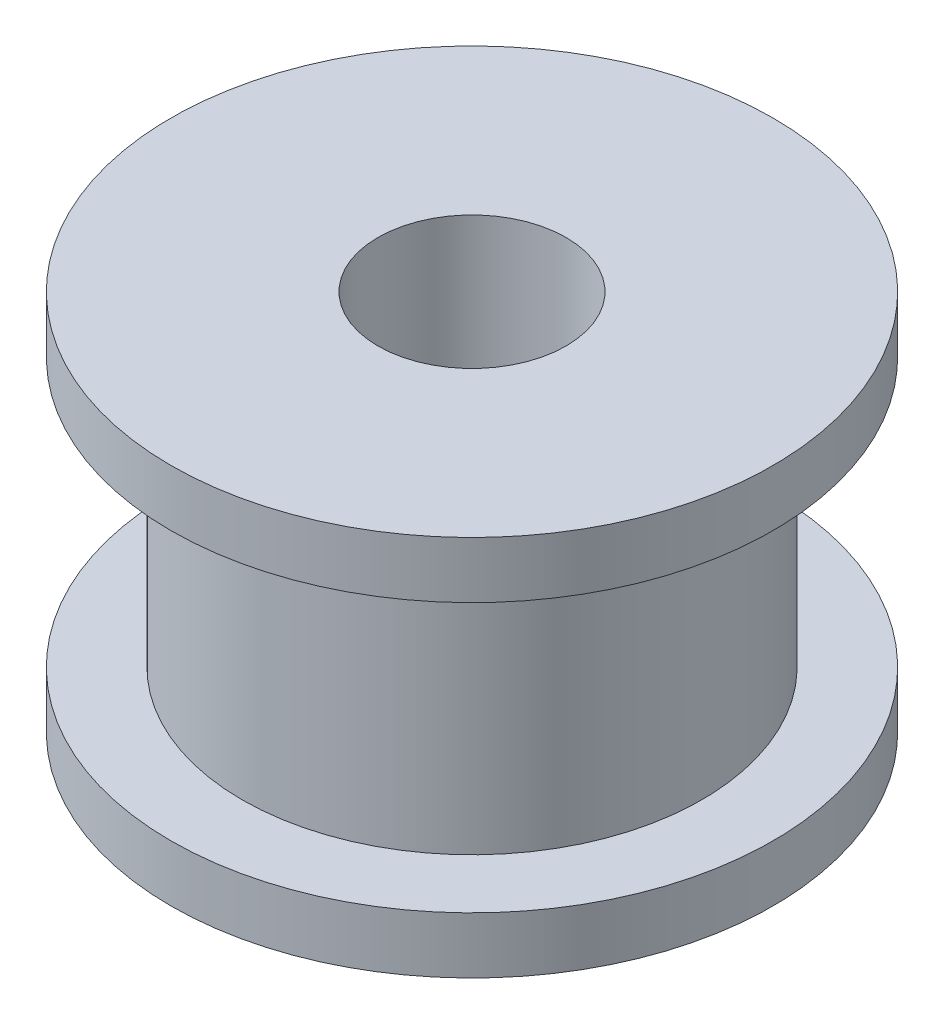
ISO-10303-21;
HEADER;
FILE_DESCRIPTION(('STEP AP214'),'2;1');
FILE_NAME('part.step','',(''),(''),'','','');
FILE_SCHEMA(('AUTOMOTIVE_DESIGN { 1 0 10303 214 1 1 1 1 }'));
ENDSEC;
DATA;
#1=APPLICATION_CONTEXT('core data for automotive mechanical design processes');
#2=APPLICATION_PROTOCOL_DEFINITION('international standard','automotive_design',2000,#1);
#3=PRODUCT_CONTEXT('',#1,'mechanical');
#4=PRODUCT('Part','Part','',(#3));
#5=PRODUCT_RELATED_PRODUCT_CATEGORY('part','',(#4));
#6=PRODUCT_DEFINITION_FORMATION('','',#4);
#7=PRODUCT_DEFINITION_CONTEXT('part definition',#1,'design');
#8=PRODUCT_DEFINITION('design','',#6,#7);
#9=PRODUCT_DEFINITION_SHAPE('','',#8);
#10=(LENGTH_UNIT() NAMED_UNIT(*) SI_UNIT(.MILLI.,.METRE.));
#11=(NAMED_UNIT(*) PLANE_ANGLE_UNIT() SI_UNIT($,.RADIAN.));
#12=(NAMED_UNIT(*) SI_UNIT($,.STERADIAN.) SOLID_ANGLE_UNIT());
#13=UNCERTAINTY_MEASURE_WITH_UNIT(LENGTH_MEASURE(1.E-05),#10,'distance_accuracy_value','');
#14=(GEOMETRIC_REPRESENTATION_CONTEXT(3) GLOBAL_UNCERTAINTY_ASSIGNED_CONTEXT((#13)) GLOBAL_UNIT_ASSIGNED_CONTEXT((#10,
#11,#12)) REPRESENTATION_CONTEXT('',''));
#15=CARTESIAN_POINT('',(0.,0.,0.));
#16=DIRECTION('',(0.,0.,1.));
#17=DIRECTION('',(1.,0.,0.));
#18=AXIS2_PLACEMENT_3D('',#15,#16,#17);
#19=CARTESIAN_POINT('',(0.,7.1,0.));
#20=DIRECTION('',(0.,-1.,0.));
#21=DIRECTION('',(0.,0.,-1.));
#22=AXIS2_PLACEMENT_3D('',#19,#20,#21);
#23=CYLINDRICAL_SURFACE('',#22,8.);
#24=CARTESIAN_POINT('',(0.,7.1,0.));
#25=DIRECTION('',(0.,1.,0.));
#26=DIRECTION('',(0.,0.,1.));
#27=AXIS2_PLACEMENT_3D('',#24,#25,#26);
#28=CIRCLE('',#27,8.);
#29=CARTESIAN_POINT('',(0.,7.1,8.));
#30=VERTEX_POINT('',#29);
#31=EDGE_CURVE('E43',#30,#30,#28,.T.);
#32=ORIENTED_EDGE('',*,*,#31,.F.);
#33=EDGE_LOOP('',(#32));
#34=FACE_BOUND('',#33,.T.);
#35=CARTESIAN_POINT('',(0.,5.6,0.));
#36=DIRECTION('',(0.,-1.,0.));
#37=DIRECTION('',(0.,0.,-1.));
#38=AXIS2_PLACEMENT_3D('',#35,#36,#37);
#39=CIRCLE('',#38,8.);
#40=CARTESIAN_POINT('',(0.,5.6,-8.));
#41=VERTEX_POINT('',#40);
#42=EDGE_CURVE('E61',#41,#41,#39,.T.);
#43=ORIENTED_EDGE('',*,*,#42,.F.);
#44=EDGE_LOOP('',(#43));
#45=FACE_BOUND('',#44,.T.);
#46=ADVANCED_FACE('F36',(#34,#45),#23,.T.);
#47=CARTESIAN_POINT('',(0.,16.,0.));
#48=DIRECTION('',(0.,-1.,0.));
#49=DIRECTION('',(0.,0.,-1.));
#50=AXIS2_PLACEMENT_3D('',#47,#48,#49);
#51=CYLINDRICAL_SURFACE('',#50,2.5);
#52=CARTESIAN_POINT('',(0.,15.74,0.));
#53=DIRECTION('',(0.,1.,0.));
#54=DIRECTION('',(0.,0.,1.));
#55=AXIS2_PLACEMENT_3D('',#52,#53,#54);
#56=CIRCLE('',#55,2.5);
#57=CARTESIAN_POINT('',(0.,15.74,2.5));
#58=VERTEX_POINT('',#57);
#59=EDGE_CURVE('E56',#58,#58,#56,.T.);
#60=ORIENTED_EDGE('',*,*,#59,.T.);
#61=EDGE_LOOP('',(#60));
#62=FACE_BOUND('',#61,.T.);
#63=CARTESIAN_POINT('',(0.,5.6,0.));
#64=DIRECTION('',(0.,-1.,0.));
#65=DIRECTION('',(0.,0.,-1.));
#66=AXIS2_PLACEMENT_3D('',#63,#64,#65);
#67=CIRCLE('',#66,2.5);
#68=CARTESIAN_POINT('',(0.,5.6,-2.5));
#69=VERTEX_POINT('',#68);
#70=EDGE_CURVE('E39',#69,#69,#67,.F.);
#71=ORIENTED_EDGE('',*,*,#70,.F.);
#72=EDGE_LOOP('',(#71));
#73=FACE_BOUND('',#72,.T.);
#74=ADVANCED_FACE('F70',(#62,#73),#51,.F.);
#75=CARTESIAN_POINT('',(0.,7.1,0.));
#76=DIRECTION('',(0.,1.,0.));
#77=DIRECTION('',(0.,0.,1.));
#78=AXIS2_PLACEMENT_3D('',#75,#76,#77);
#79=PLANE('',#78);
#80=CARTESIAN_POINT('',(0.,7.1,0.));
#81=DIRECTION('',(0.,1.,0.));
#82=DIRECTION('',(0.,0.,1.));
#83=AXIS2_PLACEMENT_3D('',#80,#81,#82);
#84=CIRCLE('',#83,6.11);
#85=CARTESIAN_POINT('',(0.,7.1,6.11));
#86=VERTEX_POINT('',#85);
#87=EDGE_CURVE('E10',#86,#86,#84,.T.);
#88=ORIENTED_EDGE('',*,*,#87,.F.);
#89=EDGE_LOOP('',(#88));
#90=FACE_BOUND('',#89,.T.);
#91=ORIENTED_EDGE('',*,*,#31,.T.);
#92=EDGE_LOOP('',(#91));
#93=FACE_BOUND('',#92,.T.);
#94=ADVANCED_FACE('F72',(#90,#93),#79,.T.);
#95=CARTESIAN_POINT('',(0.,14.24,0.));
#96=DIRECTION('',(0.,-1.,0.));
#97=DIRECTION('',(0.,0.,-1.));
#98=AXIS2_PLACEMENT_3D('',#95,#96,#97);
#99=CYLINDRICAL_SURFACE('',#98,6.11);
#100=CARTESIAN_POINT('',(0.,14.24,0.));
#101=DIRECTION('',(0.,1.,0.));
#102=DIRECTION('',(0.,0.,1.));
#103=AXIS2_PLACEMENT_3D('',#100,#101,#102);
#104=CIRCLE('',#103,6.11);
#105=CARTESIAN_POINT('',(0.,14.24,6.11));
#106=VERTEX_POINT('',#105);
#107=EDGE_CURVE('E48',#106,#106,#104,.T.);
#108=ORIENTED_EDGE('',*,*,#107,.F.);
#109=EDGE_LOOP('',(#108));
#110=FACE_BOUND('',#109,.T.);
#111=ORIENTED_EDGE('',*,*,#87,.T.);
#112=EDGE_LOOP('',(#111));
#113=FACE_BOUND('',#112,.T.);
#114=ADVANCED_FACE('F79',(#110,#113),#99,.T.);
#115=CARTESIAN_POINT('',(0.,14.24,0.));
#116=DIRECTION('',(0.,1.,0.));
#117=DIRECTION('',(0.,0.,1.));
#118=AXIS2_PLACEMENT_3D('',#115,#116,#117);
#119=PLANE('',#118);
#120=ORIENTED_EDGE('',*,*,#107,.T.);
#121=EDGE_LOOP('',(#120));
#122=FACE_BOUND('',#121,.T.);
#123=CARTESIAN_POINT('',(0.,14.24,0.));
#124=DIRECTION('',(0.,1.,0.));
#125=DIRECTION('',(0.,0.,1.));
#126=AXIS2_PLACEMENT_3D('',#123,#124,#125);
#127=CIRCLE('',#126,8.);
#128=CARTESIAN_POINT('',(0.,14.24,8.));
#129=VERTEX_POINT('',#128);
#130=EDGE_CURVE('E53',#129,#129,#127,.T.);
#131=ORIENTED_EDGE('',*,*,#130,.F.);
#132=EDGE_LOOP('',(#131));
#133=FACE_BOUND('',#132,.T.);
#134=ADVANCED_FACE('F87',(#122,#133),#119,.F.);
#135=CARTESIAN_POINT('',(0.,15.74,0.));
#136=DIRECTION('',(0.,1.,0.));
#137=DIRECTION('',(0.,0.,1.));
#138=AXIS2_PLACEMENT_3D('',#135,#136,#137);
#139=PLANE('',#138);
#140=ORIENTED_EDGE('',*,*,#59,.F.);
#141=EDGE_LOOP('',(#140));
#142=FACE_BOUND('',#141,.T.);
#143=CARTESIAN_POINT('',(0.,15.74,0.));
#144=DIRECTION('',(0.,1.,0.));
#145=DIRECTION('',(0.,0.,1.));
#146=AXIS2_PLACEMENT_3D('',#143,#144,#145);
#147=CIRCLE('',#146,8.);
#148=CARTESIAN_POINT('',(0.,15.74,8.));
#149=VERTEX_POINT('',#148);
#150=EDGE_CURVE('E52',#149,#149,#147,.T.);
#151=ORIENTED_EDGE('',*,*,#150,.T.);
#152=EDGE_LOOP('',(#151));
#153=FACE_BOUND('',#152,.T.);
#154=ADVANCED_FACE('F92',(#142,#153),#139,.T.);
#155=CARTESIAN_POINT('',(0.,15.74,0.));
#156=DIRECTION('',(0.,-1.,0.));
#157=DIRECTION('',(0.,0.,-1.));
#158=AXIS2_PLACEMENT_3D('',#155,#156,#157);
#159=CYLINDRICAL_SURFACE('',#158,8.);
#160=ORIENTED_EDGE('',*,*,#150,.F.);
#161=EDGE_LOOP('',(#160));
#162=FACE_BOUND('',#161,.T.);
#163=ORIENTED_EDGE('',*,*,#130,.T.);
#164=EDGE_LOOP('',(#163));
#165=FACE_BOUND('',#164,.T.);
#166=ADVANCED_FACE('F84',(#162,#165),#159,.T.);
#167=CARTESIAN_POINT('',(10.,5.6,8.));
#168=DIRECTION('',(0.,-1.,0.));
#169=DIRECTION('',(0.,0.,-1.));
#170=AXIS2_PLACEMENT_3D('',#167,#168,#169);
#171=PLANE('',#170);
#172=ORIENTED_EDGE('',*,*,#70,.T.);
#173=EDGE_LOOP('',(#172));
#174=FACE_BOUND('',#173,.T.);
#175=ORIENTED_EDGE('',*,*,#42,.T.);
#176=EDGE_LOOP('',(#175));
#177=FACE_BOUND('',#176,.T.);
#178=ADVANCED_FACE('F68',(#174,#177),#171,.T.);
#179=CLOSED_SHELL('',(#46,#74,#94,#114,#134,#154,#166,#178));
#180=MANIFOLD_SOLID_BREP('B2',#179);
#181=ADVANCED_BREP_SHAPE_REPRESENTATION('',(#18,#180),#14);
#182=SHAPE_DEFINITION_REPRESENTATION(#9,#181);
ENDSEC;
END-ISO-10303-21;
